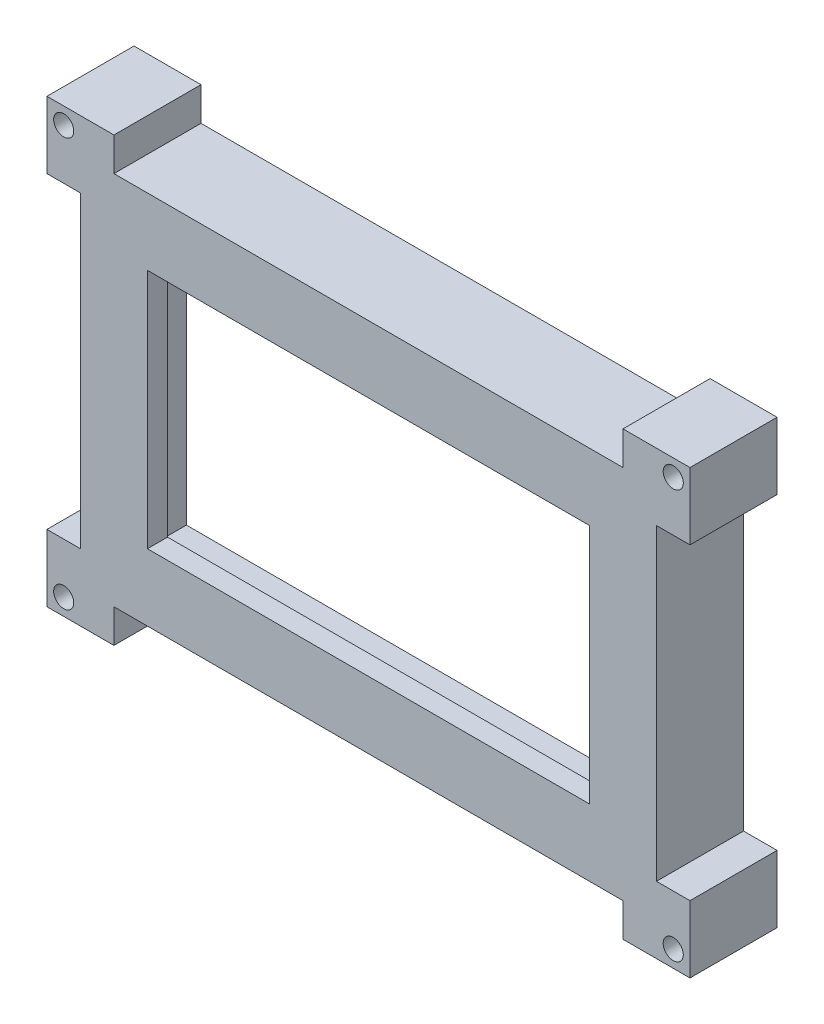
ISO-10303-21;
HEADER;
FILE_DESCRIPTION(('STEP AP214'),'2;1');
FILE_NAME('part.step','',(''),(''),'','','');
FILE_SCHEMA(('AUTOMOTIVE_DESIGN { 1 0 10303 214 1 1 1 1 }'));
ENDSEC;
DATA;
#1=APPLICATION_CONTEXT('core data for automotive mechanical design processes');
#2=APPLICATION_PROTOCOL_DEFINITION('international standard','automotive_design',2000,#1);
#3=PRODUCT_CONTEXT('',#1,'mechanical');
#4=PRODUCT('Part','Part','',(#3));
#5=PRODUCT_RELATED_PRODUCT_CATEGORY('part','',(#4));
#6=PRODUCT_DEFINITION_FORMATION('','',#4);
#7=PRODUCT_DEFINITION_CONTEXT('part definition',#1,'design');
#8=PRODUCT_DEFINITION('design','',#6,#7);
#9=PRODUCT_DEFINITION_SHAPE('','',#8);
#10=(LENGTH_UNIT() NAMED_UNIT(*) SI_UNIT(.MILLI.,.METRE.));
#11=(NAMED_UNIT(*) PLANE_ANGLE_UNIT() SI_UNIT($,.RADIAN.));
#12=(NAMED_UNIT(*) SI_UNIT($,.STERADIAN.) SOLID_ANGLE_UNIT());
#13=UNCERTAINTY_MEASURE_WITH_UNIT(LENGTH_MEASURE(1.E-05),#10,'distance_accuracy_value','');
#14=(GEOMETRIC_REPRESENTATION_CONTEXT(3) GLOBAL_UNCERTAINTY_ASSIGNED_CONTEXT((#13)) GLOBAL_UNIT_ASSIGNED_CONTEXT((#10,
#11,#12)) REPRESENTATION_CONTEXT('',''));
#15=CARTESIAN_POINT('',(0.,0.,0.));
#16=DIRECTION('',(0.,0.,1.));
#17=DIRECTION('',(1.,0.,0.));
#18=AXIS2_PLACEMENT_3D('',#15,#16,#17);
#19=CARTESIAN_POINT('',(0.,0.,10.));
#20=DIRECTION('',(0.,0.,1.));
#21=DIRECTION('',(1.,0.,0.));
#22=AXIS2_PLACEMENT_3D('',#19,#20,#21);
#23=PLANE('',#22);
#24=DIRECTION('',(0.,1.,0.));
#25=VECTOR('',#24,1.);
#26=CARTESIAN_POINT('',(42.183359051608,17.9928315412186,10.));
#27=LINE('',#26,#25);
#28=CARTESIAN_POINT('',(42.183359051608,-32.041006582728,9.99999999999999));
#29=VERTEX_POINT('',#28);
#30=CARTESIAN_POINT('',(42.183359051608,17.9928315412186,9.99999999999999));
#31=VERTEX_POINT('',#30);
#32=EDGE_CURVE('E250',#29,#31,#27,.T.);
#33=ORIENTED_EDGE('',*,*,#32,.F.);
#34=DIRECTION('',(-1.,0.,0.));
#35=VECTOR('',#34,1.);
#36=CARTESIAN_POINT('',(42.183359051608,-32.041006582728,9.99999999999999));
#37=LINE('',#36,#35);
#38=CARTESIAN_POINT('',(-37.9992670879128,-32.041006582728,9.99999999999999));
#39=VERTEX_POINT('',#38);
#40=EDGE_CURVE('E242',#29,#39,#37,.T.);
#41=ORIENTED_EDGE('',*,*,#40,.T.);
#42=DIRECTION('',(0.,1.,0.));
#43=VECTOR('',#42,1.);
#44=CARTESIAN_POINT('',(-37.9992670879128,17.9928315412186,9.99999999999999));
#45=LINE('',#44,#43);
#46=CARTESIAN_POINT('',(-37.9992670879128,17.9928315412186,9.99999999999999));
#47=VERTEX_POINT('',#46);
#48=EDGE_CURVE('E227',#39,#47,#45,.T.);
#49=ORIENTED_EDGE('',*,*,#48,.T.);
#50=DIRECTION('',(-1.,0.,0.));
#51=VECTOR('',#50,1.);
#52=CARTESIAN_POINT('',(-37.816640948392,17.9928315412186,10.));
#53=LINE('',#52,#51);
#54=EDGE_CURVE('E456',#31,#47,#53,.T.);
#55=ORIENTED_EDGE('',*,*,#54,.F.);
#56=EDGE_LOOP('',(#33,#41,#49,#55));
#57=FACE_BOUND('',#56,.T.);
#58=DIRECTION('',(-1.,0.,0.));
#59=VECTOR('',#58,1.);
#60=CARTESIAN_POINT('',(0.,10.9928315412186,10.));
#61=LINE('',#60,#59);
#62=CARTESIAN_POINT('',(35.183359051608,10.9928315412186,10.));
#63=VERTEX_POINT('',#62);
#64=CARTESIAN_POINT('',(-30.816640948392,10.9928315412186,10.));
#65=VERTEX_POINT('',#64);
#66=EDGE_CURVE('E438',#63,#65,#61,.T.);
#67=ORIENTED_EDGE('',*,*,#66,.T.);
#68=DIRECTION('',(0.,-1.,0.));
#69=VECTOR('',#68,1.);
#70=CARTESIAN_POINT('',(-30.816640948392,0.,10.));
#71=LINE('',#70,#69);
#72=CARTESIAN_POINT('',(-30.816640948392,-25.0071684587814,10.));
#73=VERTEX_POINT('',#72);
#74=EDGE_CURVE('E441',#65,#73,#71,.T.);
#75=ORIENTED_EDGE('',*,*,#74,.T.);
#76=DIRECTION('',(1.,0.,0.));
#77=VECTOR('',#76,1.);
#78=CARTESIAN_POINT('',(0.,-25.0071684587814,10.));
#79=LINE('',#78,#77);
#80=CARTESIAN_POINT('',(35.183359051608,-25.0071684587814,10.));
#81=VERTEX_POINT('',#80);
#82=EDGE_CURVE('E425',#73,#81,#79,.T.);
#83=ORIENTED_EDGE('',*,*,#82,.T.);
#84=DIRECTION('',(0.,1.,0.));
#85=VECTOR('',#84,1.);
#86=CARTESIAN_POINT('',(35.183359051608,0.,10.));
#87=LINE('',#86,#85);
#88=EDGE_CURVE('E435',#81,#63,#87,.T.);
#89=ORIENTED_EDGE('',*,*,#88,.T.);
#90=EDGE_LOOP('',(#67,#75,#83,#89));
#91=FACE_BOUND('',#90,.T.);
#92=ADVANCED_FACE('F41',(#57,#91),#23,.F.);
#93=CARTESIAN_POINT('',(-40.816640948392,20.9928315412186,10.));
#94=DIRECTION('',(0.,-1.,0.));
#95=DIRECTION('',(0.,0.,-1.));
#96=AXIS2_PLACEMENT_3D('',#93,#94,#95);
#97=PLANE('',#96);
#98=DIRECTION('',(0.,0.,-1.));
#99=VECTOR('',#98,1.);
#100=CARTESIAN_POINT('',(-35.816640948392,20.9928315412186,10.));
#101=LINE('',#100,#99);
#102=CARTESIAN_POINT('',(-35.816640948392,20.9928315412186,13.));
#103=VERTEX_POINT('',#102);
#104=CARTESIAN_POINT('',(-35.816640948392,20.9928315412186,0.));
#105=VERTEX_POINT('',#104);
#106=EDGE_CURVE('E292',#103,#105,#101,.T.);
#107=ORIENTED_EDGE('',*,*,#106,.F.);
#108=DIRECTION('',(-1.,0.,0.));
#109=VECTOR('',#108,1.);
#110=CARTESIAN_POINT('',(45.183359051608,20.9928315412186,13.));
#111=LINE('',#110,#109);
#112=CARTESIAN_POINT('',(40.183359051608,20.9928315412186,13.));
#113=VERTEX_POINT('',#112);
#114=EDGE_CURVE('E450',#113,#103,#111,.T.);
#115=ORIENTED_EDGE('',*,*,#114,.F.);
#116=DIRECTION('',(0.,0.,-1.));
#117=VECTOR('',#116,1.);
#118=CARTESIAN_POINT('',(40.183359051608,20.9928315412186,10.));
#119=LINE('',#118,#117);
#120=CARTESIAN_POINT('',(40.183359051608,20.9928315412186,0.));
#121=VERTEX_POINT('',#120);
#122=EDGE_CURVE('E338',#113,#121,#119,.T.);
#123=ORIENTED_EDGE('',*,*,#122,.T.);
#124=DIRECTION('',(-1.,0.,0.));
#125=VECTOR('',#124,1.);
#126=CARTESIAN_POINT('',(-40.816640948392,20.9928315412186,0.));
#127=LINE('',#126,#125);
#128=EDGE_CURVE('E56',#121,#105,#127,.T.);
#129=ORIENTED_EDGE('',*,*,#128,.T.);
#130=EDGE_LOOP('',(#107,#115,#123,#129));
#131=FACE_BOUND('',#130,.T.);
#132=ADVANCED_FACE('F43',(#131),#97,.F.);
#133=CARTESIAN_POINT('',(-40.816640948392,20.9928315412186,10.));
#134=DIRECTION('',(1.,0.,0.));
#135=DIRECTION('',(0.,0.,-1.));
#136=AXIS2_PLACEMENT_3D('',#133,#134,#135);
#137=PLANE('',#136);
#138=DIRECTION('',(0.,0.,1.));
#139=VECTOR('',#138,1.);
#140=CARTESIAN_POINT('',(-40.816640948392,15.9928315412186,10.));
#141=LINE('',#140,#139);
#142=CARTESIAN_POINT('',(-40.816640948392,15.9928315412186,0.));
#143=VERTEX_POINT('',#142);
#144=CARTESIAN_POINT('',(-40.816640948392,15.9928315412186,13.));
#145=VERTEX_POINT('',#144);
#146=EDGE_CURVE('E299',#143,#145,#141,.T.);
#147=ORIENTED_EDGE('',*,*,#146,.F.);
#148=DIRECTION('',(0.,-1.,0.));
#149=VECTOR('',#148,1.);
#150=CARTESIAN_POINT('',(-40.816640948392,20.9928315412186,0.));
#151=LINE('',#150,#149);
#152=CARTESIAN_POINT('',(-40.816640948392,-30.0071684587814,0.));
#153=VERTEX_POINT('',#152);
#154=EDGE_CURVE('E463',#143,#153,#151,.T.);
#155=ORIENTED_EDGE('',*,*,#154,.T.);
#156=DIRECTION('',(0.,0.,1.));
#157=VECTOR('',#156,1.);
#158=CARTESIAN_POINT('',(-40.816640948392,-30.0071684587814,10.));
#159=LINE('',#158,#157);
#160=CARTESIAN_POINT('',(-40.816640948392,-30.0071684587814,13.));
#161=VERTEX_POINT('',#160);
#162=EDGE_CURVE('E400',#153,#161,#159,.T.);
#163=ORIENTED_EDGE('',*,*,#162,.T.);
#164=DIRECTION('',(0.,-1.,0.));
#165=VECTOR('',#164,1.);
#166=CARTESIAN_POINT('',(-40.816640948392,20.9928315412186,13.));
#167=LINE('',#166,#165);
#168=EDGE_CURVE('E64',#145,#161,#167,.T.);
#169=ORIENTED_EDGE('',*,*,#168,.F.);
#170=EDGE_LOOP('',(#147,#155,#163,#169));
#171=FACE_BOUND('',#170,.T.);
#172=ADVANCED_FACE('F496',(#171),#137,.F.);
#173=CARTESIAN_POINT('',(-37.816640948392,17.9928315412186,10.));
#174=DIRECTION('',(0.,-1.,0.));
#175=DIRECTION('',(0.,0.,-1.));
#176=AXIS2_PLACEMENT_3D('',#173,#174,#175);
#177=PLANE('',#176);
#178=ORIENTED_EDGE('',*,*,#54,.T.);
#179=DIRECTION('',(0.,0.,-1.));
#180=VECTOR('',#179,1.);
#181=CARTESIAN_POINT('',(-37.9992670879128,17.9928315412186,104.512636679142));
#182=LINE('',#181,#180);
#183=CARTESIAN_POINT('',(-37.9992670879128,17.9928315412186,0.));
#184=VERTEX_POINT('',#183);
#185=EDGE_CURVE('E234',#47,#184,#182,.T.);
#186=ORIENTED_EDGE('',*,*,#185,.T.);
#187=DIRECTION('',(-1.,0.,0.));
#188=VECTOR('',#187,1.);
#189=CARTESIAN_POINT('',(-37.816640948392,17.9928315412186,0.));
#190=LINE('',#189,#188);
#191=CARTESIAN_POINT('',(42.183359051608,17.9928315412186,0.));
#192=VERTEX_POINT('',#191);
#193=EDGE_CURVE('E457',#192,#184,#190,.T.);
#194=ORIENTED_EDGE('',*,*,#193,.F.);
#195=DIRECTION('',(0.,0.,-1.));
#196=VECTOR('',#195,1.);
#197=CARTESIAN_POINT('',(42.183359051608,17.9928315412186,104.512636679142));
#198=LINE('',#197,#196);
#199=EDGE_CURVE('E256',#31,#192,#198,.T.);
#200=ORIENTED_EDGE('',*,*,#199,.F.);
#201=EDGE_LOOP('',(#178,#186,#194,#200));
#202=FACE_BOUND('',#201,.T.);
#203=ADVANCED_FACE('F500',(#202),#177,.T.);
#204=CARTESIAN_POINT('',(-40.816640948392,-35.0071684587814,10.));
#205=DIRECTION('',(0.,1.,0.));
#206=DIRECTION('',(0.,0.,1.));
#207=AXIS2_PLACEMENT_3D('',#204,#205,#206);
#208=PLANE('',#207);
#209=DIRECTION('',(0.,0.,-1.));
#210=VECTOR('',#209,1.);
#211=CARTESIAN_POINT('',(40.183359051608,-35.0071684587814,10.));
#212=LINE('',#211,#210);
#213=CARTESIAN_POINT('',(40.183359051608,-35.0071684587814,13.));
#214=VERTEX_POINT('',#213);
#215=CARTESIAN_POINT('',(40.183359051608,-35.0071684587814,0.));
#216=VERTEX_POINT('',#215);
#217=EDGE_CURVE('E370',#214,#216,#212,.T.);
#218=ORIENTED_EDGE('',*,*,#217,.F.);
#219=DIRECTION('',(1.,0.,0.));
#220=VECTOR('',#219,1.);
#221=CARTESIAN_POINT('',(-40.816640948392,-35.0071684587814,13.));
#222=LINE('',#221,#220);
#223=CARTESIAN_POINT('',(-35.816640948392,-35.0071684587814,13.));
#224=VERTEX_POINT('',#223);
#225=EDGE_CURVE('E444',#224,#214,#222,.T.);
#226=ORIENTED_EDGE('',*,*,#225,.F.);
#227=DIRECTION('',(0.,0.,-1.));
#228=VECTOR('',#227,1.);
#229=CARTESIAN_POINT('',(-35.816640948392,-35.0071684587814,10.));
#230=LINE('',#229,#228);
#231=CARTESIAN_POINT('',(-35.816640948392,-35.0071684587814,0.));
#232=VERTEX_POINT('',#231);
#233=EDGE_CURVE('E418',#224,#232,#230,.T.);
#234=ORIENTED_EDGE('',*,*,#233,.T.);
#235=DIRECTION('',(1.,0.,0.));
#236=VECTOR('',#235,1.);
#237=CARTESIAN_POINT('',(-40.816640948392,-35.0071684587814,0.));
#238=LINE('',#237,#236);
#239=EDGE_CURVE('E465',#232,#216,#238,.T.);
#240=ORIENTED_EDGE('',*,*,#239,.T.);
#241=EDGE_LOOP('',(#218,#226,#234,#240));
#242=FACE_BOUND('',#241,.T.);
#243=ADVANCED_FACE('F503',(#242),#208,.F.);
#244=CARTESIAN_POINT('',(45.183359051608,20.9928315412186,10.));
#245=DIRECTION('',(-1.,0.,0.));
#246=DIRECTION('',(0.,-1.,0.));
#247=AXIS2_PLACEMENT_3D('',#244,#245,#246);
#248=PLANE('',#247);
#249=DIRECTION('',(0.,1.,0.));
#250=VECTOR('',#249,1.);
#251=CARTESIAN_POINT('',(45.183359051608,20.9928315412186,0.));
#252=LINE('',#251,#250);
#253=CARTESIAN_POINT('',(45.183359051608,-30.0071684587814,0.));
#254=VERTEX_POINT('',#253);
#255=CARTESIAN_POINT('',(45.183359051608,15.9928315412186,0.));
#256=VERTEX_POINT('',#255);
#257=EDGE_CURVE('E467',#254,#256,#252,.T.);
#258=ORIENTED_EDGE('',*,*,#257,.T.);
#259=DIRECTION('',(0.,0.,1.));
#260=VECTOR('',#259,1.);
#261=CARTESIAN_POINT('',(45.183359051608,15.9928315412186,10.));
#262=LINE('',#261,#260);
#263=CARTESIAN_POINT('',(45.183359051608,15.9928315412187,13.));
#264=VERTEX_POINT('',#263);
#265=EDGE_CURVE('E320',#256,#264,#262,.T.);
#266=ORIENTED_EDGE('',*,*,#265,.T.);
#267=DIRECTION('',(0.,1.,0.));
#268=VECTOR('',#267,1.);
#269=CARTESIAN_POINT('',(45.183359051608,-35.0071684587814,13.));
#270=LINE('',#269,#268);
#271=CARTESIAN_POINT('',(45.183359051608,-30.0071684587814,13.));
#272=VERTEX_POINT('',#271);
#273=EDGE_CURVE('E447',#272,#264,#270,.T.);
#274=ORIENTED_EDGE('',*,*,#273,.F.);
#275=DIRECTION('',(0.,0.,1.));
#276=VECTOR('',#275,1.);
#277=CARTESIAN_POINT('',(45.183359051608,-30.0071684587814,10.));
#278=LINE('',#277,#276);
#279=EDGE_CURVE('E378',#254,#272,#278,.T.);
#280=ORIENTED_EDGE('',*,*,#279,.F.);
#281=EDGE_LOOP('',(#258,#266,#274,#280));
#282=FACE_BOUND('',#281,.T.);
#283=ADVANCED_FACE('F509',(#282),#248,.F.);
#284=CARTESIAN_POINT('',(42.183359051608,17.9928315412186,10.));
#285=DIRECTION('',(-1.,0.,0.));
#286=DIRECTION('',(0.,-1.,0.));
#287=AXIS2_PLACEMENT_3D('',#284,#285,#286);
#288=PLANE('',#287);
#289=ORIENTED_EDGE('',*,*,#32,.T.);
#290=ORIENTED_EDGE('',*,*,#199,.T.);
#291=DIRECTION('',(0.,1.,0.));
#292=VECTOR('',#291,1.);
#293=CARTESIAN_POINT('',(42.183359051608,17.9928315412186,0.));
#294=LINE('',#293,#292);
#295=CARTESIAN_POINT('',(42.183359051608,-32.041006582728,0.));
#296=VERTEX_POINT('',#295);
#297=EDGE_CURVE('E454',#296,#192,#294,.T.);
#298=ORIENTED_EDGE('',*,*,#297,.F.);
#299=DIRECTION('',(0.,0.,-1.));
#300=VECTOR('',#299,1.);
#301=CARTESIAN_POINT('',(42.183359051608,-32.041006582728,104.512636679142));
#302=LINE('',#301,#300);
#303=EDGE_CURVE('E259',#29,#296,#302,.T.);
#304=ORIENTED_EDGE('',*,*,#303,.F.);
#305=EDGE_LOOP('',(#289,#290,#298,#304));
#306=FACE_BOUND('',#305,.T.);
#307=ADVANCED_FACE('F505',(#306),#288,.T.);
#308=CARTESIAN_POINT('',(0.,0.,0.));
#309=DIRECTION('',(0.,0.,-1.));
#310=DIRECTION('',(-1.,0.,0.));
#311=AXIS2_PLACEMENT_3D('',#308,#309,#310);
#312=PLANE('',#311);
#313=ORIENTED_EDGE('',*,*,#297,.T.);
#314=ORIENTED_EDGE('',*,*,#193,.T.);
#315=DIRECTION('',(0.,1.,0.));
#316=VECTOR('',#315,1.);
#317=CARTESIAN_POINT('',(-37.9992670879128,17.9928315412186,0.));
#318=LINE('',#317,#316);
#319=CARTESIAN_POINT('',(-37.9992670879128,-32.041006582728,0.));
#320=VERTEX_POINT('',#319);
#321=EDGE_CURVE('E251',#320,#184,#318,.T.);
#322=ORIENTED_EDGE('',*,*,#321,.F.);
#323=DIRECTION('',(-1.,0.,0.));
#324=VECTOR('',#323,1.);
#325=CARTESIAN_POINT('',(42.183359051608,-32.041006582728,0.));
#326=LINE('',#325,#324);
#327=EDGE_CURVE('E245',#296,#320,#326,.T.);
#328=ORIENTED_EDGE('',*,*,#327,.F.);
#329=EDGE_LOOP('',(#313,#314,#322,#328));
#330=FACE_BOUND('',#329,.T.);
#331=DIRECTION('',(0.,-1.,0.));
#332=VECTOR('',#331,1.);
#333=CARTESIAN_POINT('',(-35.816640948392,25.9928315412186,0.));
#334=LINE('',#333,#332);
#335=CARTESIAN_POINT('',(-35.816640948392,25.9928315412186,0.));
#336=VERTEX_POINT('',#335);
#337=EDGE_CURVE('E271',#336,#105,#334,.T.);
#338=ORIENTED_EDGE('',*,*,#337,.T.);
#339=ORIENTED_EDGE('',*,*,#128,.F.);
#340=DIRECTION('',(0.,-1.,0.));
#341=VECTOR('',#340,1.);
#342=CARTESIAN_POINT('',(40.183359051608,25.9928315412186,0.));
#343=LINE('',#342,#341);
#344=CARTESIAN_POINT('',(40.183359051608,25.9928315412186,0.));
#345=VERTEX_POINT('',#344);
#346=EDGE_CURVE('E301',#345,#121,#343,.T.);
#347=ORIENTED_EDGE('',*,*,#346,.F.);
#348=DIRECTION('',(-1.,0.,0.));
#349=VECTOR('',#348,1.);
#350=CARTESIAN_POINT('',(50.183359051608,25.9928315412186,0.));
#351=LINE('',#350,#349);
#352=CARTESIAN_POINT('',(50.183359051608,25.9928315412186,0.));
#353=VERTEX_POINT('',#352);
#354=EDGE_CURVE('E326',#353,#345,#351,.T.);
#355=ORIENTED_EDGE('',*,*,#354,.F.);
#356=DIRECTION('',(0.,1.,0.));
#357=VECTOR('',#356,1.);
#358=CARTESIAN_POINT('',(50.183359051608,25.9928315412186,0.));
#359=LINE('',#358,#357);
#360=CARTESIAN_POINT('',(50.183359051608,15.9928315412187,0.));
#361=VERTEX_POINT('',#360);
#362=EDGE_CURVE('E330',#361,#353,#359,.T.);
#363=ORIENTED_EDGE('',*,*,#362,.F.);
#364=DIRECTION('',(1.,0.,0.));
#365=VECTOR('',#364,1.);
#366=CARTESIAN_POINT('',(50.183359051608,15.9928315412187,0.));
#367=LINE('',#366,#365);
#368=EDGE_CURVE('E321',#256,#361,#367,.T.);
#369=ORIENTED_EDGE('',*,*,#368,.F.);
#370=ORIENTED_EDGE('',*,*,#257,.F.);
#371=DIRECTION('',(1.,0.,0.));
#372=VECTOR('',#371,1.);
#373=CARTESIAN_POINT('',(50.183359051608,-30.0071684587814,0.));
#374=LINE('',#373,#372);
#375=CARTESIAN_POINT('',(50.183359051608,-30.0071684587814,0.));
#376=VERTEX_POINT('',#375);
#377=EDGE_CURVE('E347',#254,#376,#374,.T.);
#378=ORIENTED_EDGE('',*,*,#377,.T.);
#379=DIRECTION('',(0.,-1.,0.));
#380=VECTOR('',#379,1.);
#381=CARTESIAN_POINT('',(50.183359051608,-40.0071684587814,0.));
#382=LINE('',#381,#380);
#383=CARTESIAN_POINT('',(50.183359051608,-40.0071684587814,0.));
#384=VERTEX_POINT('',#383);
#385=EDGE_CURVE('E344',#376,#384,#382,.T.);
#386=ORIENTED_EDGE('',*,*,#385,.T.);
#387=DIRECTION('',(-1.,0.,0.));
#388=VECTOR('',#387,1.);
#389=CARTESIAN_POINT('',(50.183359051608,-40.0071684587814,0.));
#390=LINE('',#389,#388);
#391=CARTESIAN_POINT('',(40.183359051608,-40.0071684587814,0.));
#392=VERTEX_POINT('',#391);
#393=EDGE_CURVE('E341',#384,#392,#390,.T.);
#394=ORIENTED_EDGE('',*,*,#393,.T.);
#395=DIRECTION('',(0.,1.,0.));
#396=VECTOR('',#395,1.);
#397=CARTESIAN_POINT('',(40.183359051608,-40.0071684587814,0.));
#398=LINE('',#397,#396);
#399=EDGE_CURVE('E349',#392,#216,#398,.T.);
#400=ORIENTED_EDGE('',*,*,#399,.T.);
#401=ORIENTED_EDGE('',*,*,#239,.F.);
#402=DIRECTION('',(0.,1.,0.));
#403=VECTOR('',#402,1.);
#404=CARTESIAN_POINT('',(-35.816640948392,-40.0071684587814,0.));
#405=LINE('',#404,#403);
#406=CARTESIAN_POINT('',(-35.816640948392,-40.0071684587814,0.));
#407=VERTEX_POINT('',#406);
#408=EDGE_CURVE('E381',#407,#232,#405,.T.);
#409=ORIENTED_EDGE('',*,*,#408,.F.);
#410=DIRECTION('',(1.,0.,0.));
#411=VECTOR('',#410,1.);
#412=CARTESIAN_POINT('',(-45.816640948392,-40.0071684587814,0.));
#413=LINE('',#412,#411);
#414=CARTESIAN_POINT('',(-45.816640948392,-40.0071684587814,0.));
#415=VERTEX_POINT('',#414);
#416=EDGE_CURVE('E406',#415,#407,#413,.T.);
#417=ORIENTED_EDGE('',*,*,#416,.F.);
#418=DIRECTION('',(0.,-1.,0.));
#419=VECTOR('',#418,1.);
#420=CARTESIAN_POINT('',(-45.816640948392,-40.0071684587814,0.));
#421=LINE('',#420,#419);
#422=CARTESIAN_POINT('',(-45.816640948392,-30.0071684587814,0.));
#423=VERTEX_POINT('',#422);
#424=EDGE_CURVE('E410',#423,#415,#421,.T.);
#425=ORIENTED_EDGE('',*,*,#424,.F.);
#426=DIRECTION('',(-1.,0.,0.));
#427=VECTOR('',#426,1.);
#428=CARTESIAN_POINT('',(-45.816640948392,-30.0071684587814,0.));
#429=LINE('',#428,#427);
#430=EDGE_CURVE('E401',#153,#423,#429,.T.);
#431=ORIENTED_EDGE('',*,*,#430,.F.);
#432=ORIENTED_EDGE('',*,*,#154,.F.);
#433=DIRECTION('',(-1.,0.,0.));
#434=VECTOR('',#433,1.);
#435=CARTESIAN_POINT('',(-45.816640948392,15.9928315412186,0.));
#436=LINE('',#435,#434);
#437=CARTESIAN_POINT('',(-45.816640948392,15.9928315412186,0.));
#438=VERTEX_POINT('',#437);
#439=EDGE_CURVE('E269',#143,#438,#436,.T.);
#440=ORIENTED_EDGE('',*,*,#439,.T.);
#441=DIRECTION('',(0.,1.,0.));
#442=VECTOR('',#441,1.);
#443=CARTESIAN_POINT('',(-45.816640948392,25.9928315412186,0.));
#444=LINE('',#443,#442);
#445=CARTESIAN_POINT('',(-45.816640948392,25.9928315412186,0.));
#446=VERTEX_POINT('',#445);
#447=EDGE_CURVE('E266',#438,#446,#444,.T.);
#448=ORIENTED_EDGE('',*,*,#447,.T.);
#449=DIRECTION('',(1.,0.,0.));
#450=VECTOR('',#449,1.);
#451=CARTESIAN_POINT('',(-45.816640948392,25.9928315412186,0.));
#452=LINE('',#451,#450);
#453=EDGE_CURVE('E263',#446,#336,#452,.T.);
#454=ORIENTED_EDGE('',*,*,#453,.T.);
#455=EDGE_LOOP('',(#338,#339,#347,#355,#363,#369,#370,#378,#386,#394,#400,#401,#409,#417,#425,
#431,#432,#440,#448,#454));
#456=FACE_BOUND('',#455,.T.);
#457=CARTESIAN_POINT('',(-43.316640948392,23.4928315412186,0.));
#458=DIRECTION('',(0.,0.,-1.));
#459=DIRECTION('',(-1.,0.,0.));
#460=AXIS2_PLACEMENT_3D('',#457,#458,#459);
#461=CIRCLE('',#460,1.5);
#462=CARTESIAN_POINT('',(-44.816640948392,23.4928315412186,0.));
#463=VERTEX_POINT('',#462);
#464=EDGE_CURVE('E262',#463,#463,#461,.T.);
#465=ORIENTED_EDGE('',*,*,#464,.F.);
#466=EDGE_LOOP('',(#465));
#467=FACE_BOUND('',#466,.T.);
#468=CARTESIAN_POINT('',(47.683359051608,-37.5071684587814,0.));
#469=DIRECTION('',(0.,0.,-1.));
#470=DIRECTION('',(-1.,0.,0.));
#471=AXIS2_PLACEMENT_3D('',#468,#469,#470);
#472=CIRCLE('',#471,1.5);
#473=CARTESIAN_POINT('',(46.183359051608,-37.5071684587814,0.));
#474=VERTEX_POINT('',#473);
#475=EDGE_CURVE('E340',#474,#474,#472,.T.);
#476=ORIENTED_EDGE('',*,*,#475,.F.);
#477=EDGE_LOOP('',(#476));
#478=FACE_BOUND('',#477,.T.);
#479=CARTESIAN_POINT('',(-43.316640948392,-37.5071684587814,0.));
#480=DIRECTION('',(0.,0.,-1.));
#481=DIRECTION('',(-1.,0.,0.));
#482=AXIS2_PLACEMENT_3D('',#479,#480,#481);
#483=CIRCLE('',#482,1.5);
#484=CARTESIAN_POINT('',(-44.816640948392,-37.5071684587814,0.));
#485=VERTEX_POINT('',#484);
#486=EDGE_CURVE('E385',#485,#485,#483,.F.);
#487=ORIENTED_EDGE('',*,*,#486,.T.);
#488=EDGE_LOOP('',(#487));
#489=FACE_BOUND('',#488,.T.);
#490=CARTESIAN_POINT('',(47.683359051608,23.4928315412186,0.));
#491=DIRECTION('',(0.,0.,-1.));
#492=DIRECTION('',(-1.,0.,0.));
#493=AXIS2_PLACEMENT_3D('',#490,#491,#492);
#494=CIRCLE('',#493,1.5);
#495=CARTESIAN_POINT('',(46.183359051608,23.4928315412186,0.));
#496=VERTEX_POINT('',#495);
#497=EDGE_CURVE('E305',#496,#496,#494,.F.);
#498=ORIENTED_EDGE('',*,*,#497,.T.);
#499=EDGE_LOOP('',(#498));
#500=FACE_BOUND('',#499,.T.);
#501=ADVANCED_FACE('F508',(#330,#456,#467,#478,#489,#500),#312,.T.);
#502=CARTESIAN_POINT('',(0.,0.,13.));
#503=DIRECTION('',(0.,0.,1.));
#504=DIRECTION('',(1.,0.,0.));
#505=AXIS2_PLACEMENT_3D('',#502,#503,#504);
#506=PLANE('',#505);
#507=ORIENTED_EDGE('',*,*,#114,.T.);
#508=DIRECTION('',(0.,-1.,0.));
#509=VECTOR('',#508,1.);
#510=CARTESIAN_POINT('',(-35.816640948392,25.9928315412186,13.));
#511=LINE('',#510,#509);
#512=CARTESIAN_POINT('',(-35.816640948392,25.9928315412186,13.));
#513=VERTEX_POINT('',#512);
#514=EDGE_CURVE('E277',#513,#103,#511,.T.);
#515=ORIENTED_EDGE('',*,*,#514,.F.);
#516=DIRECTION('',(1.,0.,0.));
#517=VECTOR('',#516,1.);
#518=CARTESIAN_POINT('',(-45.816640948392,25.9928315412186,13.));
#519=LINE('',#518,#517);
#520=CARTESIAN_POINT('',(-45.816640948392,25.9928315412186,13.));
#521=VERTEX_POINT('',#520);
#522=EDGE_CURVE('E280',#521,#513,#519,.T.);
#523=ORIENTED_EDGE('',*,*,#522,.F.);
#524=DIRECTION('',(0.,1.,0.));
#525=VECTOR('',#524,1.);
#526=CARTESIAN_POINT('',(-45.816640948392,25.9928315412186,13.));
#527=LINE('',#526,#525);
#528=CARTESIAN_POINT('',(-45.816640948392,15.9928315412186,13.));
#529=VERTEX_POINT('',#528);
#530=EDGE_CURVE('E283',#529,#521,#527,.T.);
#531=ORIENTED_EDGE('',*,*,#530,.F.);
#532=DIRECTION('',(-1.,0.,0.));
#533=VECTOR('',#532,1.);
#534=CARTESIAN_POINT('',(-45.816640948392,15.9928315412186,13.));
#535=LINE('',#534,#533);
#536=EDGE_CURVE('E286',#145,#529,#535,.T.);
#537=ORIENTED_EDGE('',*,*,#536,.F.);
#538=ORIENTED_EDGE('',*,*,#168,.T.);
#539=DIRECTION('',(-1.,0.,0.));
#540=VECTOR('',#539,1.);
#541=CARTESIAN_POINT('',(-45.816640948392,-30.0071684587814,13.));
#542=LINE('',#541,#540);
#543=CARTESIAN_POINT('',(-45.816640948392,-30.0071684587814,13.));
#544=VERTEX_POINT('',#543);
#545=EDGE_CURVE('E389',#161,#544,#542,.T.);
#546=ORIENTED_EDGE('',*,*,#545,.T.);
#547=DIRECTION('',(0.,-1.,0.));
#548=VECTOR('',#547,1.);
#549=CARTESIAN_POINT('',(-45.816640948392,-40.0071684587814,13.));
#550=LINE('',#549,#548);
#551=CARTESIAN_POINT('',(-45.816640948392,-40.0071684587814,13.));
#552=VERTEX_POINT('',#551);
#553=EDGE_CURVE('E386',#544,#552,#550,.T.);
#554=ORIENTED_EDGE('',*,*,#553,.T.);
#555=DIRECTION('',(1.,0.,0.));
#556=VECTOR('',#555,1.);
#557=CARTESIAN_POINT('',(-45.816640948392,-40.0071684587814,13.));
#558=LINE('',#557,#556);
#559=CARTESIAN_POINT('',(-35.816640948392,-40.0071684587814,13.));
#560=VERTEX_POINT('',#559);
#561=EDGE_CURVE('E382',#552,#560,#558,.T.);
#562=ORIENTED_EDGE('',*,*,#561,.T.);
#563=DIRECTION('',(0.,1.,0.));
#564=VECTOR('',#563,1.);
#565=CARTESIAN_POINT('',(-35.816640948392,-40.0071684587814,13.));
#566=LINE('',#565,#564);
#567=EDGE_CURVE('E391',#560,#224,#566,.T.);
#568=ORIENTED_EDGE('',*,*,#567,.T.);
#569=ORIENTED_EDGE('',*,*,#225,.T.);
#570=DIRECTION('',(0.,1.,0.));
#571=VECTOR('',#570,1.);
#572=CARTESIAN_POINT('',(40.183359051608,-40.0071684587814,13.));
#573=LINE('',#572,#571);
#574=CARTESIAN_POINT('',(40.183359051608,-40.0071684587814,13.));
#575=VERTEX_POINT('',#574);
#576=EDGE_CURVE('E355',#575,#214,#573,.T.);
#577=ORIENTED_EDGE('',*,*,#576,.F.);
#578=DIRECTION('',(-1.,0.,0.));
#579=VECTOR('',#578,1.);
#580=CARTESIAN_POINT('',(50.183359051608,-40.0071684587814,13.));
#581=LINE('',#580,#579);
#582=CARTESIAN_POINT('',(50.183359051608,-40.0071684587814,13.));
#583=VERTEX_POINT('',#582);
#584=EDGE_CURVE('E358',#583,#575,#581,.T.);
#585=ORIENTED_EDGE('',*,*,#584,.F.);
#586=DIRECTION('',(0.,-1.,0.));
#587=VECTOR('',#586,1.);
#588=CARTESIAN_POINT('',(50.183359051608,-40.0071684587814,13.));
#589=LINE('',#588,#587);
#590=CARTESIAN_POINT('',(50.183359051608,-30.0071684587814,13.));
#591=VERTEX_POINT('',#590);
#592=EDGE_CURVE('E361',#591,#583,#589,.T.);
#593=ORIENTED_EDGE('',*,*,#592,.F.);
#594=DIRECTION('',(1.,0.,0.));
#595=VECTOR('',#594,1.);
#596=CARTESIAN_POINT('',(50.183359051608,-30.0071684587814,13.));
#597=LINE('',#596,#595);
#598=EDGE_CURVE('E364',#272,#591,#597,.T.);
#599=ORIENTED_EDGE('',*,*,#598,.F.);
#600=ORIENTED_EDGE('',*,*,#273,.T.);
#601=DIRECTION('',(1.,0.,0.));
#602=VECTOR('',#601,1.);
#603=CARTESIAN_POINT('',(50.183359051608,15.9928315412187,13.));
#604=LINE('',#603,#602);
#605=CARTESIAN_POINT('',(50.183359051608,15.9928315412187,13.));
#606=VERTEX_POINT('',#605);
#607=EDGE_CURVE('E309',#264,#606,#604,.T.);
#608=ORIENTED_EDGE('',*,*,#607,.T.);
#609=DIRECTION('',(0.,1.,0.));
#610=VECTOR('',#609,1.);
#611=CARTESIAN_POINT('',(50.183359051608,25.9928315412186,13.));
#612=LINE('',#611,#610);
#613=CARTESIAN_POINT('',(50.183359051608,25.9928315412186,13.));
#614=VERTEX_POINT('',#613);
#615=EDGE_CURVE('E306',#606,#614,#612,.T.);
#616=ORIENTED_EDGE('',*,*,#615,.T.);
#617=DIRECTION('',(-1.,0.,0.));
#618=VECTOR('',#617,1.);
#619=CARTESIAN_POINT('',(50.183359051608,25.9928315412186,13.));
#620=LINE('',#619,#618);
#621=CARTESIAN_POINT('',(40.183359051608,25.9928315412186,13.));
#622=VERTEX_POINT('',#621);
#623=EDGE_CURVE('E302',#614,#622,#620,.T.);
#624=ORIENTED_EDGE('',*,*,#623,.T.);
#625=DIRECTION('',(0.,-1.,0.));
#626=VECTOR('',#625,1.);
#627=CARTESIAN_POINT('',(40.183359051608,25.9928315412186,13.));
#628=LINE('',#627,#626);
#629=EDGE_CURVE('E311',#622,#113,#628,.T.);
#630=ORIENTED_EDGE('',*,*,#629,.T.);
#631=EDGE_LOOP('',(#507,#515,#523,#531,#537,#538,#546,#554,#562,#568,#569,#577,#585,#593,#599,
#600,#608,#616,#624,#630));
#632=FACE_BOUND('',#631,.T.);
#633=DIRECTION('',(0.,-1.,0.));
#634=VECTOR('',#633,1.);
#635=CARTESIAN_POINT('',(-30.816640948392,0.,13.));
#636=LINE('',#635,#634);
#637=CARTESIAN_POINT('',(-30.816640948392,10.9928315412186,13.));
#638=VERTEX_POINT('',#637);
#639=CARTESIAN_POINT('',(-30.816640948392,-25.0071684587814,13.));
#640=VERTEX_POINT('',#639);
#641=EDGE_CURVE('E11',#638,#640,#636,.T.);
#642=ORIENTED_EDGE('',*,*,#641,.F.);
#643=DIRECTION('',(-1.,0.,0.));
#644=VECTOR('',#643,1.);
#645=CARTESIAN_POINT('',(0.,10.9928315412186,13.));
#646=LINE('',#645,#644);
#647=CARTESIAN_POINT('',(35.183359051608,10.9928315412186,13.));
#648=VERTEX_POINT('',#647);
#649=EDGE_CURVE('E49',#648,#638,#646,.T.);
#650=ORIENTED_EDGE('',*,*,#649,.F.);
#651=DIRECTION('',(0.,1.,0.));
#652=VECTOR('',#651,1.);
#653=CARTESIAN_POINT('',(35.183359051608,0.,13.));
#654=LINE('',#653,#652);
#655=CARTESIAN_POINT('',(35.183359051608,-25.0071684587814,13.));
#656=VERTEX_POINT('',#655);
#657=EDGE_CURVE('E471',#656,#648,#654,.T.);
#658=ORIENTED_EDGE('',*,*,#657,.F.);
#659=DIRECTION('',(1.,0.,0.));
#660=VECTOR('',#659,1.);
#661=CARTESIAN_POINT('',(0.,-25.0071684587814,13.));
#662=LINE('',#661,#660);
#663=EDGE_CURVE('E469',#640,#656,#662,.T.);
#664=ORIENTED_EDGE('',*,*,#663,.F.);
#665=EDGE_LOOP('',(#642,#650,#658,#664));
#666=FACE_BOUND('',#665,.T.);
#667=CARTESIAN_POINT('',(-43.316640948392,-37.5071684587814,13.));
#668=DIRECTION('',(0.,0.,1.));
#669=DIRECTION('',(1.,0.,0.));
#670=AXIS2_PLACEMENT_3D('',#667,#668,#669);
#671=CIRCLE('',#670,1.5);
#672=CARTESIAN_POINT('',(-41.816640948392,-37.5071684587814,13.));
#673=VERTEX_POINT('',#672);
#674=EDGE_CURVE('E394',#673,#673,#671,.T.);
#675=ORIENTED_EDGE('',*,*,#674,.F.);
#676=EDGE_LOOP('',(#675));
#677=FACE_BOUND('',#676,.T.);
#678=CARTESIAN_POINT('',(47.683359051608,-37.5071684587814,13.));
#679=DIRECTION('',(0.,0.,-1.));
#680=DIRECTION('',(-1.,0.,0.));
#681=AXIS2_PLACEMENT_3D('',#678,#679,#680);
#682=CIRCLE('',#681,1.5);
#683=CARTESIAN_POINT('',(46.183359051608,-37.5071684587814,13.));
#684=VERTEX_POINT('',#683);
#685=EDGE_CURVE('E352',#684,#684,#682,.T.);
#686=ORIENTED_EDGE('',*,*,#685,.T.);
#687=EDGE_LOOP('',(#686));
#688=FACE_BOUND('',#687,.T.);
#689=CARTESIAN_POINT('',(47.683359051608,23.4928315412186,13.));
#690=DIRECTION('',(0.,0.,1.));
#691=DIRECTION('',(-1.,0.,0.));
#692=AXIS2_PLACEMENT_3D('',#689,#690,#691);
#693=CIRCLE('',#692,1.5);
#694=CARTESIAN_POINT('',(46.183359051608,23.4928315412186,13.));
#695=VERTEX_POINT('',#694);
#696=EDGE_CURVE('E314',#695,#695,#693,.T.);
#697=ORIENTED_EDGE('',*,*,#696,.F.);
#698=EDGE_LOOP('',(#697));
#699=FACE_BOUND('',#698,.T.);
#700=CARTESIAN_POINT('',(-43.316640948392,23.4928315412186,13.));
#701=DIRECTION('',(0.,0.,-1.));
#702=DIRECTION('',(1.,0.,0.));
#703=AXIS2_PLACEMENT_3D('',#700,#701,#702);
#704=CIRCLE('',#703,1.5);
#705=CARTESIAN_POINT('',(-41.816640948392,23.4928315412186,13.));
#706=VERTEX_POINT('',#705);
#707=EDGE_CURVE('E274',#706,#706,#704,.T.);
#708=ORIENTED_EDGE('',*,*,#707,.T.);
#709=EDGE_LOOP('',(#708));
#710=FACE_BOUND('',#709,.T.);
#711=ADVANCED_FACE('F484',(#632,#666,#677,#688,#699,#710),#506,.T.);
#712=CARTESIAN_POINT('',(-30.816640948392,10.9928315412186,0.));
#713=DIRECTION('',(-1.,0.,0.));
#714=DIRECTION('',(0.,-1.,0.));
#715=AXIS2_PLACEMENT_3D('',#712,#713,#714);
#716=PLANE('',#715);
#717=DIRECTION('',(0.,0.,1.));
#718=VECTOR('',#717,1.);
#719=CARTESIAN_POINT('',(-30.816640948392,10.9928315412186,0.));
#720=LINE('',#719,#718);
#721=EDGE_CURVE('E422',#65,#638,#720,.T.);
#722=ORIENTED_EDGE('',*,*,#721,.T.);
#723=ORIENTED_EDGE('',*,*,#641,.T.);
#724=DIRECTION('',(0.,0.,1.));
#725=VECTOR('',#724,1.);
#726=CARTESIAN_POINT('',(-30.816640948392,-25.0071684587814,0.));
#727=LINE('',#726,#725);
#728=EDGE_CURVE('E421',#73,#640,#727,.T.);
#729=ORIENTED_EDGE('',*,*,#728,.F.);
#730=ORIENTED_EDGE('',*,*,#74,.F.);
#731=EDGE_LOOP('',(#722,#723,#729,#730));
#732=FACE_BOUND('',#731,.T.);
#733=ADVANCED_FACE('F481',(#732),#716,.F.);
#734=CARTESIAN_POINT('',(-30.816640948392,10.9928315412186,0.));
#735=DIRECTION('',(0.,1.,0.));
#736=DIRECTION('',(0.,0.,1.));
#737=AXIS2_PLACEMENT_3D('',#734,#735,#736);
#738=PLANE('',#737);
#739=DIRECTION('',(0.,0.,1.));
#740=VECTOR('',#739,1.);
#741=CARTESIAN_POINT('',(35.183359051608,10.9928315412186,0.));
#742=LINE('',#741,#740);
#743=EDGE_CURVE('E426',#63,#648,#742,.T.);
#744=ORIENTED_EDGE('',*,*,#743,.T.);
#745=ORIENTED_EDGE('',*,*,#649,.T.);
#746=ORIENTED_EDGE('',*,*,#721,.F.);
#747=ORIENTED_EDGE('',*,*,#66,.F.);
#748=EDGE_LOOP('',(#744,#745,#746,#747));
#749=FACE_BOUND('',#748,.T.);
#750=ADVANCED_FACE('F475',(#749),#738,.F.);
#751=CARTESIAN_POINT('',(35.183359051608,10.9928315412186,0.));
#752=DIRECTION('',(1.,0.,0.));
#753=DIRECTION('',(0.,1.,0.));
#754=AXIS2_PLACEMENT_3D('',#751,#752,#753);
#755=PLANE('',#754);
#756=DIRECTION('',(0.,0.,1.));
#757=VECTOR('',#756,1.);
#758=CARTESIAN_POINT('',(35.183359051608,-25.0071684587814,0.));
#759=LINE('',#758,#757);
#760=EDGE_CURVE('E429',#81,#656,#759,.T.);
#761=ORIENTED_EDGE('',*,*,#760,.T.);
#762=ORIENTED_EDGE('',*,*,#657,.T.);
#763=ORIENTED_EDGE('',*,*,#743,.F.);
#764=ORIENTED_EDGE('',*,*,#88,.F.);
#765=EDGE_LOOP('',(#761,#762,#763,#764));
#766=FACE_BOUND('',#765,.T.);
#767=ADVANCED_FACE('F490',(#766),#755,.F.);
#768=CARTESIAN_POINT('',(-30.816640948392,-25.0071684587814,0.));
#769=DIRECTION('',(0.,-1.,0.));
#770=DIRECTION('',(0.,0.,-1.));
#771=AXIS2_PLACEMENT_3D('',#768,#769,#770);
#772=PLANE('',#771);
#773=ORIENTED_EDGE('',*,*,#728,.T.);
#774=ORIENTED_EDGE('',*,*,#663,.T.);
#775=ORIENTED_EDGE('',*,*,#760,.F.);
#776=ORIENTED_EDGE('',*,*,#82,.F.);
#777=EDGE_LOOP('',(#773,#774,#775,#776));
#778=FACE_BOUND('',#777,.T.);
#779=ADVANCED_FACE('F487',(#778),#772,.F.);
#780=CARTESIAN_POINT('',(-35.816640948392,-40.0071684587814,-14.142135623731));
#781=DIRECTION('',(1.,0.,0.));
#782=DIRECTION('',(0.,0.,-1.));
#783=AXIS2_PLACEMENT_3D('',#780,#781,#782);
#784=PLANE('',#783);
#785=ORIENTED_EDGE('',*,*,#233,.F.);
#786=ORIENTED_EDGE('',*,*,#567,.F.);
#787=DIRECTION('',(0.,0.,1.));
#788=VECTOR('',#787,1.);
#789=CARTESIAN_POINT('',(-35.816640948392,-40.0071684587814,-14.142135623731));
#790=LINE('',#789,#788);
#791=EDGE_CURVE('E409',#407,#560,#790,.T.);
#792=ORIENTED_EDGE('',*,*,#791,.F.);
#793=ORIENTED_EDGE('',*,*,#408,.T.);
#794=EDGE_LOOP('',(#785,#786,#792,#793));
#795=FACE_BOUND('',#794,.T.);
#796=ADVANCED_FACE('F586',(#795),#784,.T.);
#797=CARTESIAN_POINT('',(-45.816640948392,-30.0071684587814,-14.142135623731));
#798=DIRECTION('',(0.,1.,0.));
#799=DIRECTION('',(-1.,0.,0.));
#800=AXIS2_PLACEMENT_3D('',#797,#798,#799);
#801=PLANE('',#800);
#802=ORIENTED_EDGE('',*,*,#162,.F.);
#803=ORIENTED_EDGE('',*,*,#430,.T.);
#804=DIRECTION('',(0.,0.,1.));
#805=VECTOR('',#804,1.);
#806=CARTESIAN_POINT('',(-45.816640948392,-30.0071684587814,-14.142135623731));
#807=LINE('',#806,#805);
#808=EDGE_CURVE('E397',#423,#544,#807,.T.);
#809=ORIENTED_EDGE('',*,*,#808,.T.);
#810=ORIENTED_EDGE('',*,*,#545,.F.);
#811=EDGE_LOOP('',(#802,#803,#809,#810));
#812=FACE_BOUND('',#811,.T.);
#813=ADVANCED_FACE('F597',(#812),#801,.T.);
#814=CARTESIAN_POINT('',(-45.816640948392,-40.0071684587814,-14.142135623731));
#815=DIRECTION('',(0.,-1.,0.));
#816=DIRECTION('',(0.,0.,-1.));
#817=AXIS2_PLACEMENT_3D('',#814,#815,#816);
#818=PLANE('',#817);
#819=DIRECTION('',(0.,0.,1.));
#820=VECTOR('',#819,1.);
#821=CARTESIAN_POINT('',(-45.816640948392,-40.0071684587814,-14.142135623731));
#822=LINE('',#821,#820);
#823=EDGE_CURVE('E403',#415,#552,#822,.T.);
#824=ORIENTED_EDGE('',*,*,#823,.F.);
#825=ORIENTED_EDGE('',*,*,#416,.T.);
#826=ORIENTED_EDGE('',*,*,#791,.T.);
#827=ORIENTED_EDGE('',*,*,#561,.F.);
#828=EDGE_LOOP('',(#824,#825,#826,#827));
#829=FACE_BOUND('',#828,.T.);
#830=ADVANCED_FACE('F591',(#829),#818,.T.);
#831=CARTESIAN_POINT('',(-45.816640948392,-40.0071684587814,-14.142135623731));
#832=DIRECTION('',(-1.,0.,0.));
#833=DIRECTION('',(0.,0.,1.));
#834=AXIS2_PLACEMENT_3D('',#831,#832,#833);
#835=PLANE('',#834);
#836=ORIENTED_EDGE('',*,*,#808,.F.);
#837=ORIENTED_EDGE('',*,*,#424,.T.);
#838=ORIENTED_EDGE('',*,*,#823,.T.);
#839=ORIENTED_EDGE('',*,*,#553,.F.);
#840=EDGE_LOOP('',(#836,#837,#838,#839));
#841=FACE_BOUND('',#840,.T.);
#842=ADVANCED_FACE('F594',(#841),#835,.T.);
#843=CARTESIAN_POINT('',(-43.316640948392,-37.5071684587814,-14.142135623731));
#844=DIRECTION('',(0.,0.,1.));
#845=DIRECTION('',(1.,0.,0.));
#846=AXIS2_PLACEMENT_3D('',#843,#844,#845);
#847=CYLINDRICAL_SURFACE('',#846,1.5);
#848=ORIENTED_EDGE('',*,*,#674,.T.);
#849=EDGE_LOOP('',(#848));
#850=FACE_BOUND('',#849,.T.);
#851=ORIENTED_EDGE('',*,*,#486,.F.);
#852=EDGE_LOOP('',(#851));
#853=FACE_BOUND('',#852,.T.);
#854=ADVANCED_FACE('F610',(#850,#853),#847,.F.);
#855=CARTESIAN_POINT('',(50.183359051608,-30.0071684587814,-14.142135623731));
#856=DIRECTION('',(0.,-1.,0.));
#857=DIRECTION('',(1.,0.,0.));
#858=AXIS2_PLACEMENT_3D('',#855,#856,#857);
#859=PLANE('',#858);
#860=ORIENTED_EDGE('',*,*,#377,.F.);
#861=ORIENTED_EDGE('',*,*,#279,.T.);
#862=ORIENTED_EDGE('',*,*,#598,.T.);
#863=DIRECTION('',(0.,0.,1.));
#864=VECTOR('',#863,1.);
#865=CARTESIAN_POINT('',(50.183359051608,-30.0071684587814,-14.142135623731));
#866=LINE('',#865,#864);
#867=EDGE_CURVE('E367',#376,#591,#866,.T.);
#868=ORIENTED_EDGE('',*,*,#867,.F.);
#869=EDGE_LOOP('',(#860,#861,#862,#868));
#870=FACE_BOUND('',#869,.T.);
#871=ADVANCED_FACE('F569',(#870),#859,.F.);
#872=CARTESIAN_POINT('',(40.183359051608,-40.0071684587814,-14.142135623731));
#873=DIRECTION('',(1.,0.,0.));
#874=DIRECTION('',(0.,1.,0.));
#875=AXIS2_PLACEMENT_3D('',#872,#873,#874);
#876=PLANE('',#875);
#877=ORIENTED_EDGE('',*,*,#576,.T.);
#878=ORIENTED_EDGE('',*,*,#217,.T.);
#879=ORIENTED_EDGE('',*,*,#399,.F.);
#880=DIRECTION('',(0.,0.,1.));
#881=VECTOR('',#880,1.);
#882=CARTESIAN_POINT('',(40.183359051608,-40.0071684587814,-14.142135623731));
#883=LINE('',#882,#881);
#884=EDGE_CURVE('E366',#392,#575,#883,.T.);
#885=ORIENTED_EDGE('',*,*,#884,.T.);
#886=EDGE_LOOP('',(#877,#878,#879,#885));
#887=FACE_BOUND('',#886,.T.);
#888=ADVANCED_FACE('F580',(#887),#876,.F.);
#889=CARTESIAN_POINT('',(50.183359051608,-40.0071684587814,-14.142135623731));
#890=DIRECTION('',(0.,1.,0.));
#891=DIRECTION('',(-1.,0.,0.));
#892=AXIS2_PLACEMENT_3D('',#889,#890,#891);
#893=PLANE('',#892);
#894=ORIENTED_EDGE('',*,*,#393,.F.);
#895=DIRECTION('',(0.,0.,1.));
#896=VECTOR('',#895,1.);
#897=CARTESIAN_POINT('',(50.183359051608,-40.0071684587814,-14.142135623731));
#898=LINE('',#897,#896);
#899=EDGE_CURVE('E371',#384,#583,#898,.T.);
#900=ORIENTED_EDGE('',*,*,#899,.T.);
#901=ORIENTED_EDGE('',*,*,#584,.T.);
#902=ORIENTED_EDGE('',*,*,#884,.F.);
#903=EDGE_LOOP('',(#894,#900,#901,#902));
#904=FACE_BOUND('',#903,.T.);
#905=ADVANCED_FACE('F577',(#904),#893,.F.);
#906=CARTESIAN_POINT('',(50.183359051608,-40.0071684587814,-14.142135623731));
#907=DIRECTION('',(-1.,0.,0.));
#908=DIRECTION('',(0.,-1.,0.));
#909=AXIS2_PLACEMENT_3D('',#906,#907,#908);
#910=PLANE('',#909);
#911=ORIENTED_EDGE('',*,*,#385,.F.);
#912=ORIENTED_EDGE('',*,*,#867,.T.);
#913=ORIENTED_EDGE('',*,*,#592,.T.);
#914=ORIENTED_EDGE('',*,*,#899,.F.);
#915=EDGE_LOOP('',(#911,#912,#913,#914));
#916=FACE_BOUND('',#915,.T.);
#917=ADVANCED_FACE('F572',(#916),#910,.F.);
#918=CARTESIAN_POINT('',(47.683359051608,-37.5071684587814,-14.142135623731));
#919=DIRECTION('',(0.,0.,1.));
#920=DIRECTION('',(1.,0.,0.));
#921=AXIS2_PLACEMENT_3D('',#918,#919,#920);
#922=CYLINDRICAL_SURFACE('',#921,1.5);
#923=ORIENTED_EDGE('',*,*,#685,.F.);
#924=EDGE_LOOP('',(#923));
#925=FACE_BOUND('',#924,.T.);
#926=ORIENTED_EDGE('',*,*,#475,.T.);
#927=EDGE_LOOP('',(#926));
#928=FACE_BOUND('',#927,.T.);
#929=ADVANCED_FACE('F740',(#925,#928),#922,.F.);
#930=CARTESIAN_POINT('',(40.183359051608,25.9928315412186,-14.142135623731));
#931=DIRECTION('',(-1.,0.,0.));
#932=DIRECTION('',(0.,-1.,0.));
#933=AXIS2_PLACEMENT_3D('',#930,#931,#932);
#934=PLANE('',#933);
#935=ORIENTED_EDGE('',*,*,#122,.F.);
#936=ORIENTED_EDGE('',*,*,#629,.F.);
#937=DIRECTION('',(0.,0.,1.));
#938=VECTOR('',#937,1.);
#939=CARTESIAN_POINT('',(40.183359051608,25.9928315412186,-14.142135623731));
#940=LINE('',#939,#938);
#941=EDGE_CURVE('E329',#345,#622,#940,.T.);
#942=ORIENTED_EDGE('',*,*,#941,.F.);
#943=ORIENTED_EDGE('',*,*,#346,.T.);
#944=EDGE_LOOP('',(#935,#936,#942,#943));
#945=FACE_BOUND('',#944,.T.);
#946=ADVANCED_FACE('F549',(#945),#934,.T.);
#947=CARTESIAN_POINT('',(50.183359051608,15.9928315412187,-14.142135623731));
#948=DIRECTION('',(0.,-1.,0.));
#949=DIRECTION('',(1.,0.,0.));
#950=AXIS2_PLACEMENT_3D('',#947,#948,#949);
#951=PLANE('',#950);
#952=ORIENTED_EDGE('',*,*,#265,.F.);
#953=ORIENTED_EDGE('',*,*,#368,.T.);
#954=DIRECTION('',(0.,0.,1.));
#955=VECTOR('',#954,1.);
#956=CARTESIAN_POINT('',(50.183359051608,15.9928315412187,-14.142135623731));
#957=LINE('',#956,#955);
#958=EDGE_CURVE('E317',#361,#606,#957,.T.);
#959=ORIENTED_EDGE('',*,*,#958,.T.);
#960=ORIENTED_EDGE('',*,*,#607,.F.);
#961=EDGE_LOOP('',(#952,#953,#959,#960));
#962=FACE_BOUND('',#961,.T.);
#963=ADVANCED_FACE('F562',(#962),#951,.T.);
#964=CARTESIAN_POINT('',(50.183359051608,25.9928315412186,-14.142135623731));
#965=DIRECTION('',(0.,1.,0.));
#966=DIRECTION('',(-1.,0.,0.));
#967=AXIS2_PLACEMENT_3D('',#964,#965,#966);
#968=PLANE('',#967);
#969=DIRECTION('',(0.,0.,1.));
#970=VECTOR('',#969,1.);
#971=CARTESIAN_POINT('',(50.183359051608,25.9928315412186,-14.142135623731));
#972=LINE('',#971,#970);
#973=EDGE_CURVE('E323',#353,#614,#972,.T.);
#974=ORIENTED_EDGE('',*,*,#973,.F.);
#975=ORIENTED_EDGE('',*,*,#354,.T.);
#976=ORIENTED_EDGE('',*,*,#941,.T.);
#977=ORIENTED_EDGE('',*,*,#623,.F.);
#978=EDGE_LOOP('',(#974,#975,#976,#977));
#979=FACE_BOUND('',#978,.T.);
#980=ADVANCED_FACE('F555',(#979),#968,.T.);
#981=CARTESIAN_POINT('',(50.183359051608,25.9928315412186,-14.142135623731));
#982=DIRECTION('',(1.,0.,0.));
#983=DIRECTION('',(0.,1.,0.));
#984=AXIS2_PLACEMENT_3D('',#981,#982,#983);
#985=PLANE('',#984);
#986=ORIENTED_EDGE('',*,*,#958,.F.);
#987=ORIENTED_EDGE('',*,*,#362,.T.);
#988=ORIENTED_EDGE('',*,*,#973,.T.);
#989=ORIENTED_EDGE('',*,*,#615,.F.);
#990=EDGE_LOOP('',(#986,#987,#988,#989));
#991=FACE_BOUND('',#990,.T.);
#992=ADVANCED_FACE('F558',(#991),#985,.T.);
#993=CARTESIAN_POINT('',(47.683359051608,23.4928315412186,-14.142135623731));
#994=DIRECTION('',(0.,0.,1.));
#995=DIRECTION('',(1.,0.,0.));
#996=AXIS2_PLACEMENT_3D('',#993,#994,#995);
#997=CYLINDRICAL_SURFACE('',#996,1.5);
#998=ORIENTED_EDGE('',*,*,#696,.T.);
#999=EDGE_LOOP('',(#998));
#1000=FACE_BOUND('',#999,.T.);
#1001=ORIENTED_EDGE('',*,*,#497,.F.);
#1002=EDGE_LOOP('',(#1001));
#1003=FACE_BOUND('',#1002,.T.);
#1004=ADVANCED_FACE('F700',(#1000,#1003),#997,.F.);
#1005=CARTESIAN_POINT('',(-45.816640948392,15.9928315412186,-14.142135623731));
#1006=DIRECTION('',(0.,1.,0.));
#1007=DIRECTION('',(-1.,0.,0.));
#1008=AXIS2_PLACEMENT_3D('',#1005,#1006,#1007);
#1009=PLANE('',#1008);
#1010=ORIENTED_EDGE('',*,*,#439,.F.);
#1011=ORIENTED_EDGE('',*,*,#146,.T.);
#1012=ORIENTED_EDGE('',*,*,#536,.T.);
#1013=DIRECTION('',(0.,0.,1.));
#1014=VECTOR('',#1013,1.);
#1015=CARTESIAN_POINT('',(-45.816640948392,15.9928315412186,-14.142135623731));
#1016=LINE('',#1015,#1014);
#1017=EDGE_CURVE('E289',#438,#529,#1016,.T.);
#1018=ORIENTED_EDGE('',*,*,#1017,.F.);
#1019=EDGE_LOOP('',(#1010,#1011,#1012,#1018));
#1020=FACE_BOUND('',#1019,.T.);
#1021=ADVANCED_FACE('F527',(#1020),#1009,.F.);
#1022=CARTESIAN_POINT('',(-35.816640948392,25.9928315412186,-14.142135623731));
#1023=DIRECTION('',(-1.,0.,0.));
#1024=DIRECTION('',(0.,0.,1.));
#1025=AXIS2_PLACEMENT_3D('',#1022,#1023,#1024);
#1026=PLANE('',#1025);
#1027=ORIENTED_EDGE('',*,*,#514,.T.);
#1028=ORIENTED_EDGE('',*,*,#106,.T.);
#1029=ORIENTED_EDGE('',*,*,#337,.F.);
#1030=DIRECTION('',(0.,0.,1.));
#1031=VECTOR('',#1030,1.);
#1032=CARTESIAN_POINT('',(-35.816640948392,25.9928315412186,-14.142135623731));
#1033=LINE('',#1032,#1031);
#1034=EDGE_CURVE('E288',#336,#513,#1033,.T.);
#1035=ORIENTED_EDGE('',*,*,#1034,.T.);
#1036=EDGE_LOOP('',(#1027,#1028,#1029,#1035));
#1037=FACE_BOUND('',#1036,.T.);
#1038=ADVANCED_FACE('F541',(#1037),#1026,.F.);
#1039=CARTESIAN_POINT('',(-45.816640948392,25.9928315412186,-14.142135623731));
#1040=DIRECTION('',(0.,-1.,0.));
#1041=DIRECTION('',(0.,0.,-1.));
#1042=AXIS2_PLACEMENT_3D('',#1039,#1040,#1041);
#1043=PLANE('',#1042);
#1044=ORIENTED_EDGE('',*,*,#453,.F.);
#1045=DIRECTION('',(0.,0.,1.));
#1046=VECTOR('',#1045,1.);
#1047=CARTESIAN_POINT('',(-45.816640948392,25.9928315412186,-14.142135623731));
#1048=LINE('',#1047,#1046);
#1049=EDGE_CURVE('E293',#446,#521,#1048,.T.);
#1050=ORIENTED_EDGE('',*,*,#1049,.T.);
#1051=ORIENTED_EDGE('',*,*,#522,.T.);
#1052=ORIENTED_EDGE('',*,*,#1034,.F.);
#1053=EDGE_LOOP('',(#1044,#1050,#1051,#1052));
#1054=FACE_BOUND('',#1053,.T.);
#1055=ADVANCED_FACE('F538',(#1054),#1043,.F.);
#1056=CARTESIAN_POINT('',(-45.816640948392,25.9928315412186,-14.142135623731));
#1057=DIRECTION('',(1.,0.,0.));
#1058=DIRECTION('',(0.,0.,-1.));
#1059=AXIS2_PLACEMENT_3D('',#1056,#1057,#1058);
#1060=PLANE('',#1059);
#1061=ORIENTED_EDGE('',*,*,#447,.F.);
#1062=ORIENTED_EDGE('',*,*,#1017,.T.);
#1063=ORIENTED_EDGE('',*,*,#530,.T.);
#1064=ORIENTED_EDGE('',*,*,#1049,.F.);
#1065=EDGE_LOOP('',(#1061,#1062,#1063,#1064));
#1066=FACE_BOUND('',#1065,.T.);
#1067=ADVANCED_FACE('F533',(#1066),#1060,.F.);
#1068=CARTESIAN_POINT('',(-43.316640948392,23.4928315412186,-14.142135623731));
#1069=DIRECTION('',(0.,0.,1.));
#1070=DIRECTION('',(1.,0.,0.));
#1071=AXIS2_PLACEMENT_3D('',#1068,#1069,#1070);
#1072=CYLINDRICAL_SURFACE('',#1071,1.5);
#1073=ORIENTED_EDGE('',*,*,#707,.F.);
#1074=EDGE_LOOP('',(#1073));
#1075=FACE_BOUND('',#1074,.T.);
#1076=ORIENTED_EDGE('',*,*,#464,.T.);
#1077=EDGE_LOOP('',(#1076));
#1078=FACE_BOUND('',#1077,.T.);
#1079=ADVANCED_FACE('F662',(#1075,#1078),#1072,.F.);
#1080=CARTESIAN_POINT('',(-37.9992670879128,17.9928315412186,104.512636679142));
#1081=DIRECTION('',(-1.,0.,0.));
#1082=DIRECTION('',(0.,0.,1.));
#1083=AXIS2_PLACEMENT_3D('',#1080,#1081,#1082);
#1084=PLANE('',#1083);
#1085=DIRECTION('',(0.,0.,-1.));
#1086=VECTOR('',#1085,1.);
#1087=CARTESIAN_POINT('',(-37.9992670879128,-32.041006582728,104.512636679142));
#1088=LINE('',#1087,#1086);
#1089=EDGE_CURVE('E231',#39,#320,#1088,.T.);
#1090=ORIENTED_EDGE('',*,*,#1089,.T.);
#1091=ORIENTED_EDGE('',*,*,#321,.T.);
#1092=ORIENTED_EDGE('',*,*,#185,.F.);
#1093=ORIENTED_EDGE('',*,*,#48,.F.);
#1094=EDGE_LOOP('',(#1090,#1091,#1092,#1093));
#1095=FACE_BOUND('',#1094,.T.);
#1096=ADVANCED_FACE('F229',(#1095),#1084,.F.);
#1097=CARTESIAN_POINT('',(42.183359051608,-32.041006582728,104.512636679142));
#1098=DIRECTION('',(0.,-1.,0.));
#1099=DIRECTION('',(0.,0.,-1.));
#1100=AXIS2_PLACEMENT_3D('',#1097,#1098,#1099);
#1101=PLANE('',#1100);
#1102=ORIENTED_EDGE('',*,*,#303,.T.);
#1103=ORIENTED_EDGE('',*,*,#327,.T.);
#1104=ORIENTED_EDGE('',*,*,#1089,.F.);
#1105=ORIENTED_EDGE('',*,*,#40,.F.);
#1106=EDGE_LOOP('',(#1102,#1103,#1104,#1105));
#1107=FACE_BOUND('',#1106,.T.);
#1108=ADVANCED_FACE('F241',(#1107),#1101,.F.);
#1109=CLOSED_SHELL('',(#92,#132,#172,#203,#243,#283,#307,#501,#711,#733,#750,#767,#779,#796,
#813,#830,#842,#854,#871,#888,#905,#917,#929,#946,#963,#980,#992,#1004,#1021,#1038,#1055,#1067,
#1079,#1096,#1108));
#1110=MANIFOLD_SOLID_BREP('B2',#1109);
#1111=ADVANCED_BREP_SHAPE_REPRESENTATION('',(#18,#1110),#14);
#1112=SHAPE_DEFINITION_REPRESENTATION(#9,#1111);
ENDSEC;
END-ISO-10303-21;
